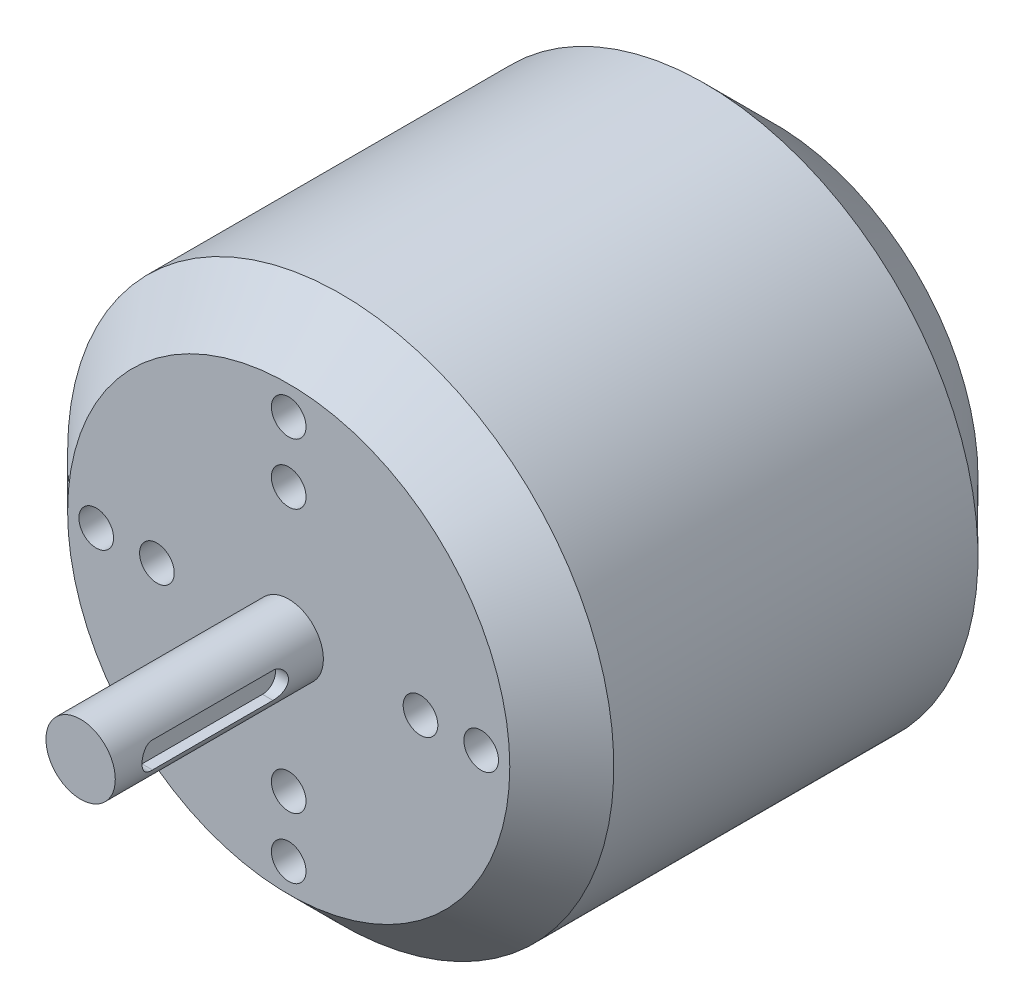
ISO-10303-21;
HEADER;
FILE_DESCRIPTION(('STEP AP214'),'2;1');
FILE_NAME('part.step','',(''),(''),'','','');
FILE_SCHEMA(('AUTOMOTIVE_DESIGN { 1 0 10303 214 1 1 1 1 }'));
ENDSEC;
DATA;
#1=APPLICATION_CONTEXT('core data for automotive mechanical design processes');
#2=APPLICATION_PROTOCOL_DEFINITION('international standard','automotive_design',2000,#1);
#3=PRODUCT_CONTEXT('',#1,'mechanical');
#4=PRODUCT('Part','Part','',(#3));
#5=PRODUCT_RELATED_PRODUCT_CATEGORY('part','',(#4));
#6=PRODUCT_DEFINITION_FORMATION('','',#4);
#7=PRODUCT_DEFINITION_CONTEXT('part definition',#1,'design');
#8=PRODUCT_DEFINITION('design','',#6,#7);
#9=PRODUCT_DEFINITION_SHAPE('','',#8);
#10=(LENGTH_UNIT() NAMED_UNIT(*) SI_UNIT(.MILLI.,.METRE.));
#11=(NAMED_UNIT(*) PLANE_ANGLE_UNIT() SI_UNIT($,.RADIAN.));
#12=(NAMED_UNIT(*) SI_UNIT($,.STERADIAN.) SOLID_ANGLE_UNIT());
#13=UNCERTAINTY_MEASURE_WITH_UNIT(LENGTH_MEASURE(1.E-05),#10,'distance_accuracy_value','');
#14=(GEOMETRIC_REPRESENTATION_CONTEXT(3) GLOBAL_UNCERTAINTY_ASSIGNED_CONTEXT((#13)) GLOBAL_UNIT_ASSIGNED_CONTEXT((#10,
#11,#12)) REPRESENTATION_CONTEXT('',''));
#15=CARTESIAN_POINT('',(0.,0.,0.));
#16=DIRECTION('',(0.,0.,1.));
#17=DIRECTION('',(1.,0.,0.));
#18=AXIS2_PLACEMENT_3D('',#15,#16,#17);
#19=CARTESIAN_POINT('',(0.,0.,72.));
#20=DIRECTION('',(0.,0.,-1.));
#21=DIRECTION('',(-1.,0.,0.));
#22=AXIS2_PLACEMENT_3D('',#19,#20,#21);
#23=CYLINDRICAL_SURFACE('',#22,4.);
#24=CARTESIAN_POINT('',(0.,0.,48.));
#25=DIRECTION('',(0.,0.,1.));
#26=DIRECTION('',(1.,0.,0.));
#27=AXIS2_PLACEMENT_3D('',#24,#25,#26);
#28=CIRCLE('',#27,4.);
#29=CARTESIAN_POINT('',(4.,0.,48.));
#30=VERTEX_POINT('',#29);
#31=EDGE_CURVE('E163',#30,#30,#28,.T.);
#32=ORIENTED_EDGE('',*,*,#31,.T.);
#33=EDGE_LOOP('',(#32));
#34=FACE_BOUND('',#33,.T.);
#35=CARTESIAN_POINT('',(0.,0.,72.));
#36=DIRECTION('',(0.,0.,1.));
#37=DIRECTION('',(1.,0.,0.));
#38=AXIS2_PLACEMENT_3D('',#35,#36,#37);
#39=CIRCLE('',#38,4.);
#40=CARTESIAN_POINT('',(4.,0.,72.));
#41=VERTEX_POINT('',#40);
#42=EDGE_CURVE('E157',#41,#41,#39,.T.);
#43=ORIENTED_EDGE('',*,*,#42,.F.);
#44=EDGE_LOOP('',(#43));
#45=FACE_BOUND('',#44,.T.);
#46=CARTESIAN_POINT('',(3.70809924354783,1.5,67.4185376928396));
#47=CARTESIAN_POINT('',(3.70809443619348,1.50000149729856,67.4591302258692));
#48=CARTESIAN_POINT('',(3.70876663375751,1.49835118206537,67.4997016221274));
#49=CARTESIAN_POINT('',(3.71141673218275,1.49177905295192,67.5805222315669));
#50=CARTESIAN_POINT('',(3.7133941946446,1.48685833749724,67.6207715483328));
#51=CARTESIAN_POINT('',(3.72118975606221,1.46729482367934,67.7403049085649));
#52=CARTESIAN_POINT('',(3.72887188404209,1.44784998767984,67.8187373530668));
#53=CARTESIAN_POINT('',(3.74825217997878,1.39690233043372,67.9709052113547));
#54=CARTESIAN_POINT('',(3.7599469632381,1.36540966903062,68.0446445218803));
#55=CARTESIAN_POINT('',(3.7860238820009,1.29134097725474,68.1858712129009));
#56=CARTESIAN_POINT('',(3.80040821426565,1.24875587557703,68.253353414852));
#57=CARTESIAN_POINT('',(3.83103589828726,1.15146603872017,68.3834296127803));
#58=CARTESIAN_POINT('',(3.84733374054252,1.09630269892844,68.4456677071578));
#59=CARTESIAN_POINT('',(3.8794978206844,0.976394584974257,68.560261285857));
#60=CARTESIAN_POINT('',(3.8953639745168,0.911647960429704,68.61261485718));
#61=CARTESIAN_POINT('',(3.92552893891845,0.771693719740037,68.7076779070932));
#62=CARTESIAN_POINT('',(3.93975598379754,0.696204968758626,68.7499982935233));
#63=CARTESIAN_POINT('',(3.96438035322528,0.53855362230492,68.8211896039225));
#64=CARTESIAN_POINT('',(3.97477910532575,0.456393528521804,68.8500655423265));
#65=CARTESIAN_POINT('',(3.99018690464435,0.291490050670588,68.8922954116612));
#66=CARTESIAN_POINT('',(3.99540906103972,0.20892464921191,68.9062650771436));
#67=CARTESIAN_POINT('',(4.00064014015322,0.0424658385808888,68.9202588907716));
#68=CARTESIAN_POINT('',(4.00065066686691,-0.0414271540462085,68.9202873296415));
#69=CARTESIAN_POINT('',(3.99559264174046,-0.203744100069406,68.9067558866106));
#70=CARTESIAN_POINT('',(3.99077535168083,-0.282233282883082,68.8938682176322));
#71=CARTESIAN_POINT('',(3.97693262269583,-0.435840275995115,68.8560014217274));
#72=CARTESIAN_POINT('',(3.96790694481372,-0.51095789458693,68.8310216081933));
#73=CARTESIAN_POINT('',(3.94637770601049,-0.656988917196577,68.7693673002438));
#74=CARTESIAN_POINT('',(3.93382542785069,-0.727825198012178,68.7325278519162));
#75=CARTESIAN_POINT('',(3.90651314175191,-0.862486444375064,68.6483456552665));
#76=CARTESIAN_POINT('',(3.89175241632298,-0.926309119580088,68.6009994910523));
#77=CARTESIAN_POINT('',(3.86052643048223,-1.04908600084313,68.4939145613485));
#78=CARTESIAN_POINT('',(3.84401196825707,-1.10753779261244,68.4336133085046));
#79=CARTESIAN_POINT('',(3.81182684214318,-1.21369725159035,68.3039535584618));
#80=CARTESIAN_POINT('',(3.79615651174147,-1.26140069584828,68.2345915181922));
#81=CARTESIAN_POINT('',(3.7671186794103,-1.34567998313248,68.0867796644258));
#82=CARTESIAN_POINT('',(3.75381153298453,-1.38197861969245,68.008159287172));
#83=CARTESIAN_POINT('',(3.73171449181344,-1.44059114536973,67.8453313709977));
#84=CARTESIAN_POINT('',(3.72291700934124,-1.46292853893353,67.7611334879067));
#85=CARTESIAN_POINT('',(3.7140622685257,-1.48519272209728,67.6331566751918));
#86=CARTESIAN_POINT('',(3.71183476402566,-1.49074028414002,67.590435363319));
#87=CARTESIAN_POINT('',(3.70885093143242,-1.49814308997677,67.5046636239679));
#88=CARTESIAN_POINT('',(3.70809323601798,-1.50000176547338,67.4616135398102));
#89=CARTESIAN_POINT('',(3.70809924354783,-1.5,67.4185376928396));
#90=B_SPLINE_CURVE_WITH_KNOTS('',3,(#46,#47,#48,#49,#50,#51,#52,#53,#54,#55,#56,#57,#58,#59,#60,
#61,#62,#63,#64,#65,#66,#67,#68,#69,#70,#71,#72,#73,#74,#75,#76,#77,#78,#79,#80,#81,#82,#83,#84,
#85,#86,#87,#88,#89),.UNSPECIFIED.,.F.,.F.,(4,2,2,2,2,2,2,2,2,2,2,2,2,2,2,2,2,2,2,2,2,4),(0.,
0.121697465666185,0.243354077586423,0.485593064591345,0.727628221921996,0.969861938431276,
1.22298027419407,1.47614754705133,1.73793539440998,1.9996255232324,2.25002925199203,
2.50035591335681,2.73829765644058,2.97625291175452,3.21767225141683,3.45917019544674,
3.71477993951631,3.97048993642582,4.23200510445915,4.4930788043249,4.62233004062785,
4.75146098044212),.UNSPECIFIED.);
#91=CARTESIAN_POINT('',(3.70809924354783,1.5,67.4185376928396));
#92=VERTEX_POINT('',#91);
#93=CARTESIAN_POINT('',(3.70809924354783,-1.5,67.4185376928396));
#94=VERTEX_POINT('',#93);
#95=EDGE_CURVE('E11',#92,#94,#90,.T.);
#96=ORIENTED_EDGE('',*,*,#95,.F.);
#97=DIRECTION('',(0.,0.,-1.));
#98=VECTOR('',#97,1.);
#99=CARTESIAN_POINT('',(3.70809924354783,1.5,72.));
#100=LINE('',#99,#98);
#101=CARTESIAN_POINT('',(3.70809924354783,1.5,53.5270847484594));
#102=VERTEX_POINT('',#101);
#103=EDGE_CURVE('E166',#102,#92,#100,.F.);
#104=ORIENTED_EDGE('',*,*,#103,.F.);
#105=CARTESIAN_POINT('',(3.70809924354783,-1.5,53.5270847484594));
#106=CARTESIAN_POINT('',(3.70809443619348,-1.50000149729856,53.4864922154298));
#107=CARTESIAN_POINT('',(3.70876663375751,-1.49835118206537,53.4459208191717));
#108=CARTESIAN_POINT('',(3.71141673218275,-1.49177905295192,53.3651002097321));
#109=CARTESIAN_POINT('',(3.7133941946446,-1.48685833749724,53.3248508929662));
#110=CARTESIAN_POINT('',(3.72118975606221,-1.46729482367935,53.2053175327342));
#111=CARTESIAN_POINT('',(3.72887188404209,-1.44784998767984,53.1268850882323));
#112=CARTESIAN_POINT('',(3.74825217997878,-1.39690233043372,52.9747172299443));
#113=CARTESIAN_POINT('',(3.7599469632381,-1.36540966903062,52.9009779194187));
#114=CARTESIAN_POINT('',(3.7860238820009,-1.29134097725474,52.7597512283981));
#115=CARTESIAN_POINT('',(3.80040821426565,-1.24875587557702,52.692269026447));
#116=CARTESIAN_POINT('',(3.83103589828726,-1.15146603872017,52.5621928285187));
#117=CARTESIAN_POINT('',(3.84733374054252,-1.09630269892843,52.4999547341412));
#118=CARTESIAN_POINT('',(3.8794978206844,-0.976394584974257,52.385361155442));
#119=CARTESIAN_POINT('',(3.8953639745168,-0.911647960429703,52.333007584119));
#120=CARTESIAN_POINT('',(3.92552893891845,-0.771693719740038,52.2379445342058));
#121=CARTESIAN_POINT('',(3.93975598379754,-0.696204968758629,52.1956241477757));
#122=CARTESIAN_POINT('',(3.96438035322528,-0.538553622304924,52.1244328373765));
#123=CARTESIAN_POINT('',(3.97477910532575,-0.456393528521805,52.0955568989725));
#124=CARTESIAN_POINT('',(3.99018690464435,-0.291490050670587,52.0533270296378));
#125=CARTESIAN_POINT('',(3.99540906103972,-0.208924649211908,52.0393573641555));
#126=CARTESIAN_POINT('',(4.00064014015322,-0.0424658385808867,52.0253635505274));
#127=CARTESIAN_POINT('',(4.00065066686691,0.0414271540462115,52.0253351116575));
#128=CARTESIAN_POINT('',(3.99559264174045,0.203744100069408,52.0388665546884));
#129=CARTESIAN_POINT('',(3.99077535168083,0.282233282883084,52.0517542236668));
#130=CARTESIAN_POINT('',(3.97693262269583,0.435840275995115,52.0896210195716));
#131=CARTESIAN_POINT('',(3.96790694481372,0.51095789458693,52.1146008331057));
#132=CARTESIAN_POINT('',(3.94637770601049,0.656988917196577,52.1762551410552));
#133=CARTESIAN_POINT('',(3.93382542785069,0.727825198012178,52.2130945893828));
#134=CARTESIAN_POINT('',(3.90651314175191,0.862486444375064,52.2972767860325));
#135=CARTESIAN_POINT('',(3.89175241632298,0.926309119580088,52.3446229502468));
#136=CARTESIAN_POINT('',(3.86052643048223,1.04908600084313,52.4517078799505));
#137=CARTESIAN_POINT('',(3.84401196825707,1.10753779261244,52.5120091327944));
#138=CARTESIAN_POINT('',(3.81182684214318,1.21369725159035,52.6416688828372));
#139=CARTESIAN_POINT('',(3.79615651174147,1.26140069584828,52.7110309231069));
#140=CARTESIAN_POINT('',(3.7671186794103,1.34567998313248,52.8588427768732));
#141=CARTESIAN_POINT('',(3.75381153298453,1.38197861969245,52.937463154127));
#142=CARTESIAN_POINT('',(3.73171449181344,1.44059114536973,53.1002910703013));
#143=CARTESIAN_POINT('',(3.72291700934124,1.46292853893353,53.1844889533924));
#144=CARTESIAN_POINT('',(3.7140622685257,1.48519272209728,53.3124657661072));
#145=CARTESIAN_POINT('',(3.71183476402566,1.49074028414002,53.35518707798));
#146=CARTESIAN_POINT('',(3.70885093143242,1.49814308997677,53.4409588173312));
#147=CARTESIAN_POINT('',(3.70809323601798,1.50000176547338,53.4840089014888));
#148=CARTESIAN_POINT('',(3.70809924354783,1.5,53.5270847484594));
#149=B_SPLINE_CURVE_WITH_KNOTS('',3,(#105,#106,#107,#108,#109,#110,#111,#112,#113,#114,#115,
#116,#117,#118,#119,#120,#121,#122,#123,#124,#125,#126,#127,#128,#129,#130,#131,#132,#133,#134,
#135,#136,#137,#138,#139,#140,#141,#142,#143,#144,#145,#146,#147,#148),.UNSPECIFIED.,.F.,.F.,(4,
2,2,2,2,2,2,2,2,2,2,2,2,2,2,2,2,2,2,2,2,4),(0.,0.121697465666185,0.243354077586416,
0.485593064591345,0.727628221922012,0.969861938431285,1.22298027419407,1.47614754705134,
1.73793539440997,1.9996255232324,2.25002925199203,2.50035591335681,2.73829765644058,
2.97625291175452,3.21767225141682,3.45917019544674,3.71477993951631,3.97048993642583,
4.23200510445915,4.49307880432491,4.62233004062784,4.75146098044213),.UNSPECIFIED.);
#150=CARTESIAN_POINT('',(3.70809924354783,-1.5,53.5270847484594));
#151=VERTEX_POINT('',#150);
#152=EDGE_CURVE('E185',#151,#102,#149,.T.);
#153=ORIENTED_EDGE('',*,*,#152,.F.);
#154=DIRECTION('',(0.,0.,-1.));
#155=VECTOR('',#154,1.);
#156=CARTESIAN_POINT('',(3.70809924354783,-1.5,72.));
#157=LINE('',#156,#155);
#158=EDGE_CURVE('E52',#94,#151,#157,.T.);
#159=ORIENTED_EDGE('',*,*,#158,.F.);
#160=EDGE_LOOP('',(#96,#104,#153,#159));
#161=FACE_BOUND('',#160,.T.);
#162=ADVANCED_FACE('F38',(#34,#45,#161),#23,.T.);
#163=CARTESIAN_POINT('',(0.,0.,42.));
#164=DIRECTION('',(0.,0.,-1.));
#165=DIRECTION('',(-1.,0.,0.));
#166=AXIS2_PLACEMENT_3D('',#163,#164,#165);
#167=CYLINDRICAL_SURFACE('',#166,31.5);
#168=CARTESIAN_POINT('',(0.,0.,0.));
#169=DIRECTION('',(0.,0.,-1.));
#170=DIRECTION('',(-1.,0.,0.));
#171=AXIS2_PLACEMENT_3D('',#168,#169,#170);
#172=CIRCLE('',#171,31.5);
#173=CARTESIAN_POINT('',(-31.5,0.,0.));
#174=VERTEX_POINT('',#173);
#175=EDGE_CURVE('E173',#174,#174,#172,.F.);
#176=CARTESIAN_POINT('',(0.,0.,42.));
#177=DIRECTION('',(0.,0.,1.));
#178=DIRECTION('',(1.,0.,0.));
#179=AXIS2_PLACEMENT_3D('',#176,#177,#178);
#180=CIRCLE('',#179,31.5);
#181=CARTESIAN_POINT('',(-31.5,0.,42.));
#182=VERTEX_POINT('',#181);
#183=EDGE_CURVE('E176',#182,#182,#180,.F.);
#184=CARTESIAN_POINT('',(-31.5,0.,0.));
#185=CARTESIAN_POINT('',(-31.5,0.,0.4375));
#186=CARTESIAN_POINT('',(-31.5,0.,0.875000000000001));
#187=CARTESIAN_POINT('',(-31.5,0.,1.75));
#188=CARTESIAN_POINT('',(-31.5,0.,2.1875));
#189=CARTESIAN_POINT('',(-31.5,0.,3.0625));
#190=CARTESIAN_POINT('',(-31.5,0.,3.5));
#191=CARTESIAN_POINT('',(-31.5,0.,4.375));
#192=CARTESIAN_POINT('',(-31.5,0.,4.8125));
#193=CARTESIAN_POINT('',(-31.5,0.,5.6875));
#194=CARTESIAN_POINT('',(-31.5,0.,6.125));
#195=CARTESIAN_POINT('',(-31.5,0.,7.));
#196=CARTESIAN_POINT('',(-31.5,0.,7.4375));
#197=CARTESIAN_POINT('',(-31.5,0.,8.3125));
#198=CARTESIAN_POINT('',(-31.5,0.,8.75));
#199=CARTESIAN_POINT('',(-31.5,0.,9.625));
#200=CARTESIAN_POINT('',(-31.5,0.,10.0625));
#201=CARTESIAN_POINT('',(-31.5,0.,10.9375));
#202=CARTESIAN_POINT('',(-31.5,0.,11.375));
#203=CARTESIAN_POINT('',(-31.5,0.,12.25));
#204=CARTESIAN_POINT('',(-31.5,0.,12.6875));
#205=CARTESIAN_POINT('',(-31.5,0.,13.5625));
#206=CARTESIAN_POINT('',(-31.5,0.,14.));
#207=CARTESIAN_POINT('',(-31.5,0.,14.875));
#208=CARTESIAN_POINT('',(-31.5,0.,15.3125));
#209=CARTESIAN_POINT('',(-31.5,0.,16.1875));
#210=CARTESIAN_POINT('',(-31.5,0.,16.625));
#211=CARTESIAN_POINT('',(-31.5,0.,17.5));
#212=CARTESIAN_POINT('',(-31.5,0.,17.9375));
#213=CARTESIAN_POINT('',(-31.5,0.,18.8125));
#214=CARTESIAN_POINT('',(-31.5,0.,19.25));
#215=CARTESIAN_POINT('',(-31.5,0.,20.125));
#216=CARTESIAN_POINT('',(-31.5,0.,20.5625));
#217=CARTESIAN_POINT('',(-31.5,0.,21.4375));
#218=CARTESIAN_POINT('',(-31.5,0.,21.875));
#219=CARTESIAN_POINT('',(-31.5,0.,22.75));
#220=CARTESIAN_POINT('',(-31.5,0.,23.1875));
#221=CARTESIAN_POINT('',(-31.5,0.,24.0625));
#222=CARTESIAN_POINT('',(-31.5,0.,24.5));
#223=CARTESIAN_POINT('',(-31.5,0.,25.375));
#224=CARTESIAN_POINT('',(-31.5,0.,25.8125));
#225=CARTESIAN_POINT('',(-31.5,0.,26.6875));
#226=CARTESIAN_POINT('',(-31.5,0.,27.125));
#227=CARTESIAN_POINT('',(-31.5,0.,28.));
#228=CARTESIAN_POINT('',(-31.5,0.,28.4375));
#229=CARTESIAN_POINT('',(-31.5,0.,29.3125));
#230=CARTESIAN_POINT('',(-31.5,0.,29.75));
#231=CARTESIAN_POINT('',(-31.5,0.,30.625));
#232=CARTESIAN_POINT('',(-31.5,0.,31.0625));
#233=CARTESIAN_POINT('',(-31.5,0.,31.9375));
#234=CARTESIAN_POINT('',(-31.5,0.,32.375));
#235=CARTESIAN_POINT('',(-31.5,0.,33.25));
#236=CARTESIAN_POINT('',(-31.5,0.,33.6875));
#237=CARTESIAN_POINT('',(-31.5,0.,34.5625));
#238=CARTESIAN_POINT('',(-31.5,0.,35.));
#239=CARTESIAN_POINT('',(-31.5,0.,35.875));
#240=CARTESIAN_POINT('',(-31.5,0.,36.3125));
#241=CARTESIAN_POINT('',(-31.5,0.,37.1875));
#242=CARTESIAN_POINT('',(-31.5,0.,37.625));
#243=CARTESIAN_POINT('',(-31.5,0.,38.5));
#244=CARTESIAN_POINT('',(-31.5,0.,38.9375));
#245=CARTESIAN_POINT('',(-31.5,0.,39.8125));
#246=CARTESIAN_POINT('',(-31.5,0.,40.25));
#247=CARTESIAN_POINT('',(-31.5,0.,41.125));
#248=CARTESIAN_POINT('',(-31.5,0.,41.5625));
#249=CARTESIAN_POINT('',(-31.5,0.,42.));
#250=B_SPLINE_CURVE_WITH_KNOTS('',3,(#184,#185,#186,#187,#188,#189,#190,#191,#192,#193,#194,
#195,#196,#197,#198,#199,#200,#201,#202,#203,#204,#205,#206,#207,#208,#209,#210,#211,#212,#213,
#214,#215,#216,#217,#218,#219,#220,#221,#222,#223,#224,#225,#226,#227,#228,#229,#230,#231,#232,
#233,#234,#235,#236,#237,#238,#239,#240,#241,#242,#243,#244,#245,#246,#247,#248,#249),
.UNSPECIFIED.,.F.,.F.,(4,2,2,2,2,2,2,2,2,2,2,2,2,2,2,2,2,2,2,2,2,2,2,2,2,2,2,2,2,2,2,2,4),(0.,
1.3125,2.625,3.9375,5.25,6.5625,7.875,9.1875,10.5,11.8125,13.125,14.4375,15.75,17.0625,18.375,
19.6875,21.,22.3125,23.625,24.9375,26.25,27.5625,28.875,30.1875,31.5,32.8125,34.125,35.4375,
36.75,38.0625,39.375,40.6875,42.),.UNSPECIFIED.);
#251=EDGE_CURVE('BSEAM279',#174,#182,#250,.T.);
#252=ORIENTED_EDGE('',*,*,#175,.T.);
#253=ORIENTED_EDGE('',*,*,#183,.T.);
#254=ORIENTED_EDGE('',*,*,#251,.T.);
#255=ORIENTED_EDGE('',*,*,#251,.F.);
#256=EDGE_LOOP('',(#252,#254,#253,#255));
#257=FACE_BOUND('',#256,.T.);
#258=ADVANCED_FACE('F279',(#257),#167,.T.);
#259=CARTESIAN_POINT('',(0.,0.,48.));
#260=DIRECTION('',(0.,0.,1.));
#261=DIRECTION('',(1.,0.,0.));
#262=AXIS2_PLACEMENT_3D('',#259,#260,#261);
#263=PLANE('',#262);
#264=CARTESIAN_POINT('',(2.10232574252353E-12,-15.2,48.));
#265=DIRECTION('',(0.,0.,1.));
#266=DIRECTION('',(1.,0.,0.));
#267=AXIS2_PLACEMENT_3D('',#264,#265,#266);
#268=CIRCLE('',#267,2.00000000000211);
#269=CARTESIAN_POINT('',(2.00000000000421,-15.2,48.));
#270=VERTEX_POINT('',#269);
#271=EDGE_CURVE('E115',#270,#270,#268,.T.);
#272=ORIENTED_EDGE('',*,*,#271,.F.);
#273=EDGE_LOOP('',(#272));
#274=FACE_BOUND('',#273,.T.);
#275=CARTESIAN_POINT('',(22.200000000001,1.05159149764147E-12,48.));
#276=DIRECTION('',(0.,0.,1.));
#277=DIRECTION('',(1.,0.,0.));
#278=AXIS2_PLACEMENT_3D('',#275,#276,#277);
#279=CIRCLE('',#278,2.00000000000077);
#280=CARTESIAN_POINT('',(24.2000000000018,1.05159149764147E-12,48.));
#281=VERTEX_POINT('',#280);
#282=EDGE_CURVE('E134',#281,#281,#279,.T.);
#283=ORIENTED_EDGE('',*,*,#282,.F.);
#284=EDGE_LOOP('',(#283));
#285=FACE_BOUND('',#284,.T.);
#286=CARTESIAN_POINT('',(15.2000000000011,1.05116287126176E-12,48.));
#287=DIRECTION('',(0.,0.,1.));
#288=DIRECTION('',(1.,0.,0.));
#289=AXIS2_PLACEMENT_3D('',#286,#287,#288);
#290=CIRCLE('',#289,2.00000000000075);
#291=CARTESIAN_POINT('',(17.2000000000018,1.05116287126176E-12,48.));
#292=VERTEX_POINT('',#291);
#293=EDGE_CURVE('E133',#292,#292,#290,.T.);
#294=ORIENTED_EDGE('',*,*,#293,.F.);
#295=EDGE_LOOP('',(#294));
#296=FACE_BOUND('',#295,.T.);
#297=CARTESIAN_POINT('',(0.,22.2,48.));
#298=DIRECTION('',(0.,0.,1.));
#299=DIRECTION('',(1.,0.,0.));
#300=AXIS2_PLACEMENT_3D('',#297,#298,#299);
#301=CIRCLE('',#300,2.);
#302=CARTESIAN_POINT('',(2.,22.2,48.));
#303=VERTEX_POINT('',#302);
#304=EDGE_CURVE('E146',#303,#303,#301,.T.);
#305=ORIENTED_EDGE('',*,*,#304,.F.);
#306=EDGE_LOOP('',(#305));
#307=FACE_BOUND('',#306,.T.);
#308=CARTESIAN_POINT('',(2.10318299528293E-12,-22.2,48.));
#309=DIRECTION('',(0.,0.,1.));
#310=DIRECTION('',(1.,0.,0.));
#311=AXIS2_PLACEMENT_3D('',#308,#309,#310);
#312=CIRCLE('',#311,2.00000000000216);
#313=CARTESIAN_POINT('',(2.00000000000426,-22.2,48.));
#314=VERTEX_POINT('',#313);
#315=EDGE_CURVE('E116',#314,#314,#312,.T.);
#316=ORIENTED_EDGE('',*,*,#315,.F.);
#317=EDGE_LOOP('',(#316));
#318=FACE_BOUND('',#317,.T.);
#319=CARTESIAN_POINT('',(-15.199999999999,-1.05302433439647E-12,48.));
#320=DIRECTION('',(0.,0.,1.));
#321=DIRECTION('',(1.,0.,0.));
#322=AXIS2_PLACEMENT_3D('',#319,#320,#321);
#323=CIRCLE('',#322,2.00000000000147);
#324=CARTESIAN_POINT('',(-13.1999999999975,-1.05302433439647E-12,48.));
#325=VERTEX_POINT('',#324);
#326=EDGE_CURVE('E122',#325,#325,#323,.T.);
#327=ORIENTED_EDGE('',*,*,#326,.F.);
#328=EDGE_LOOP('',(#327));
#329=FACE_BOUND('',#328,.T.);
#330=CARTESIAN_POINT('',(-22.199999999999,-1.05431021353557E-12,48.));
#331=DIRECTION('',(0.,0.,1.));
#332=DIRECTION('',(1.,0.,0.));
#333=AXIS2_PLACEMENT_3D('',#330,#331,#332);
#334=CIRCLE('',#333,2.00000000000154);
#335=CARTESIAN_POINT('',(-20.1999999999974,-1.05431021353557E-12,48.));
#336=VERTEX_POINT('',#335);
#337=EDGE_CURVE('E89',#336,#336,#334,.T.);
#338=ORIENTED_EDGE('',*,*,#337,.F.);
#339=EDGE_LOOP('',(#338));
#340=FACE_BOUND('',#339,.T.);
#341=CARTESIAN_POINT('',(0.,15.2,48.));
#342=DIRECTION('',(0.,0.,1.));
#343=DIRECTION('',(1.,0.,0.));
#344=AXIS2_PLACEMENT_3D('',#341,#342,#343);
#345=CIRCLE('',#344,2.);
#346=CARTESIAN_POINT('',(2.,15.2,48.));
#347=VERTEX_POINT('',#346);
#348=EDGE_CURVE('E145',#347,#347,#345,.T.);
#349=ORIENTED_EDGE('',*,*,#348,.F.);
#350=EDGE_LOOP('',(#349));
#351=FACE_BOUND('',#350,.T.);
#352=ORIENTED_EDGE('',*,*,#31,.F.);
#353=EDGE_LOOP('',(#352));
#354=FACE_BOUND('',#353,.T.);
#355=CARTESIAN_POINT('',(0.,0.,48.));
#356=DIRECTION('',(0.,0.,1.));
#357=DIRECTION('',(1.,0.,0.));
#358=AXIS2_PLACEMENT_3D('',#355,#356,#357);
#359=CIRCLE('',#358,25.5);
#360=CARTESIAN_POINT('',(25.5,0.,48.));
#361=VERTEX_POINT('',#360);
#362=EDGE_CURVE('E170',#361,#361,#359,.T.);
#363=ORIENTED_EDGE('',*,*,#362,.T.);
#364=EDGE_LOOP('',(#363));
#365=FACE_BOUND('',#364,.T.);
#366=ADVANCED_FACE('F284',(#274,#285,#296,#307,#318,#329,#340,#351,#354,#365),#263,.T.);
#367=CARTESIAN_POINT('',(0.,0.,48.));
#368=DIRECTION('',(0.,0.,-1.));
#369=DIRECTION('',(-1.,0.,0.));
#370=AXIS2_PLACEMENT_3D('',#367,#368,#369);
#371=CONICAL_SURFACE('',#370,25.5,0.785398163397448);
#372=ORIENTED_EDGE('',*,*,#183,.F.);
#373=EDGE_LOOP('',(#372));
#374=FACE_BOUND('',#373,.T.);
#375=ORIENTED_EDGE('',*,*,#362,.F.);
#376=EDGE_LOOP('',(#375));
#377=FACE_BOUND('',#376,.T.);
#378=ADVANCED_FACE('F450',(#374,#377),#371,.T.);
#379=CARTESIAN_POINT('',(0.,0.,-8.));
#380=DIRECTION('',(0.,0.,-1.));
#381=DIRECTION('',(-1.,0.,0.));
#382=AXIS2_PLACEMENT_3D('',#379,#380,#381);
#383=PLANE('',#382);
#384=CARTESIAN_POINT('',(0.,0.,-8.));
#385=DIRECTION('',(0.,0.,-1.));
#386=DIRECTION('',(-1.,0.,0.));
#387=AXIS2_PLACEMENT_3D('',#384,#385,#386);
#388=CIRCLE('',#387,7.5);
#389=CARTESIAN_POINT('',(-7.5,0.,-8.));
#390=VERTEX_POINT('',#389);
#391=EDGE_CURVE('E167',#390,#390,#388,.T.);
#392=ORIENTED_EDGE('',*,*,#391,.F.);
#393=EDGE_LOOP('',(#392));
#394=FACE_BOUND('',#393,.T.);
#395=CARTESIAN_POINT('',(0.,0.,-8.));
#396=DIRECTION('',(0.,0.,-1.));
#397=DIRECTION('',(-1.,0.,0.));
#398=AXIS2_PLACEMENT_3D('',#395,#396,#397);
#399=CIRCLE('',#398,23.5);
#400=CARTESIAN_POINT('',(-23.5,0.,-8.));
#401=VERTEX_POINT('',#400);
#402=EDGE_CURVE('E179',#401,#401,#399,.T.);
#403=ORIENTED_EDGE('',*,*,#402,.T.);
#404=EDGE_LOOP('',(#403));
#405=FACE_BOUND('',#404,.T.);
#406=ADVANCED_FACE('F483',(#394,#405),#383,.T.);
#407=CARTESIAN_POINT('',(0.,0.,-8.));
#408=DIRECTION('',(0.,0.,1.));
#409=DIRECTION('',(1.,0.,0.));
#410=AXIS2_PLACEMENT_3D('',#407,#408,#409);
#411=CONICAL_SURFACE('',#410,23.5,0.785398163397448);
#412=ORIENTED_EDGE('',*,*,#175,.F.);
#413=EDGE_LOOP('',(#412));
#414=FACE_BOUND('',#413,.T.);
#415=ORIENTED_EDGE('',*,*,#402,.F.);
#416=EDGE_LOOP('',(#415));
#417=FACE_BOUND('',#416,.T.);
#418=ADVANCED_FACE('F40',(#414,#417),#411,.T.);
#419=CARTESIAN_POINT('',(0.,0.,-9.));
#420=DIRECTION('',(0.,0.,1.));
#421=DIRECTION('',(1.,0.,0.));
#422=AXIS2_PLACEMENT_3D('',#419,#420,#421);
#423=CYLINDRICAL_SURFACE('',#422,7.5);
#424=CARTESIAN_POINT('',(0.,0.,-9.));
#425=DIRECTION('',(0.,0.,-1.));
#426=DIRECTION('',(-1.,0.,0.));
#427=AXIS2_PLACEMENT_3D('',#424,#425,#426);
#428=CIRCLE('',#427,7.5);
#429=CARTESIAN_POINT('',(-7.5,0.,-9.));
#430=VERTEX_POINT('',#429);
#431=EDGE_CURVE('E162',#430,#430,#428,.T.);
#432=ORIENTED_EDGE('',*,*,#431,.F.);
#433=EDGE_LOOP('',(#432));
#434=FACE_BOUND('',#433,.T.);
#435=ORIENTED_EDGE('',*,*,#391,.T.);
#436=EDGE_LOOP('',(#435));
#437=FACE_BOUND('',#436,.T.);
#438=ADVANCED_FACE('F276',(#434,#437),#423,.T.);
#439=CARTESIAN_POINT('',(0.,0.,-9.));
#440=DIRECTION('',(0.,0.,-1.));
#441=DIRECTION('',(-1.,0.,0.));
#442=AXIS2_PLACEMENT_3D('',#439,#440,#441);
#443=PLANE('',#442);
#444=ORIENTED_EDGE('',*,*,#431,.T.);
#445=EDGE_LOOP('',(#444));
#446=FACE_BOUND('',#445,.T.);
#447=ADVANCED_FACE('F271',(#446),#443,.T.);
#448=CARTESIAN_POINT('',(0.,0.,72.));
#449=DIRECTION('',(0.,0.,1.));
#450=DIRECTION('',(1.,0.,0.));
#451=AXIS2_PLACEMENT_3D('',#448,#449,#450);
#452=PLANE('',#451);
#453=ORIENTED_EDGE('',*,*,#42,.T.);
#454=EDGE_LOOP('',(#453));
#455=FACE_BOUND('',#454,.T.);
#456=ADVANCED_FACE('F268',(#455),#452,.T.);
#457=CARTESIAN_POINT('',(0.,15.2,40.));
#458=DIRECTION('',(0.,0.,1.));
#459=DIRECTION('',(1.,0.,0.));
#460=AXIS2_PLACEMENT_3D('',#457,#458,#459);
#461=CYLINDRICAL_SURFACE('',#460,2.);
#462=CARTESIAN_POINT('',(0.,15.2,40.));
#463=DIRECTION('',(0.,0.,1.));
#464=DIRECTION('',(1.,0.,0.));
#465=AXIS2_PLACEMENT_3D('',#462,#463,#464);
#466=CIRCLE('',#465,2.);
#467=CARTESIAN_POINT('',(2.,15.2,40.));
#468=VERTEX_POINT('',#467);
#469=EDGE_CURVE('E154',#468,#468,#466,.T.);
#470=ORIENTED_EDGE('',*,*,#469,.F.);
#471=EDGE_LOOP('',(#470));
#472=FACE_BOUND('',#471,.T.);
#473=ORIENTED_EDGE('',*,*,#348,.T.);
#474=EDGE_LOOP('',(#473));
#475=FACE_BOUND('',#474,.T.);
#476=ADVANCED_FACE('F265',(#472,#475),#461,.F.);
#477=CARTESIAN_POINT('',(0.,15.2,40.));
#478=DIRECTION('',(0.,0.,1.));
#479=DIRECTION('',(1.,0.,0.));
#480=AXIS2_PLACEMENT_3D('',#477,#478,#479);
#481=PLANE('',#480);
#482=ORIENTED_EDGE('',*,*,#469,.T.);
#483=EDGE_LOOP('',(#482));
#484=FACE_BOUND('',#483,.T.);
#485=ADVANCED_FACE('F231',(#484),#481,.T.);
#486=CARTESIAN_POINT('',(-22.199999999999,-1.05431021353557E-12,40.));
#487=DIRECTION('',(0.,0.,1.));
#488=DIRECTION('',(1.,0.,0.));
#489=AXIS2_PLACEMENT_3D('',#486,#487,#488);
#490=CYLINDRICAL_SURFACE('',#489,2.00000000000154);
#491=CARTESIAN_POINT('',(-22.199999999999,-1.05431021353557E-12,40.));
#492=DIRECTION('',(0.,0.,1.));
#493=DIRECTION('',(1.,0.,0.));
#494=AXIS2_PLACEMENT_3D('',#491,#492,#493);
#495=CIRCLE('',#494,2.00000000000154);
#496=CARTESIAN_POINT('',(-20.1999999999974,-1.05431021353557E-12,40.));
#497=VERTEX_POINT('',#496);
#498=EDGE_CURVE('E125',#497,#497,#495,.T.);
#499=ORIENTED_EDGE('',*,*,#498,.F.);
#500=EDGE_LOOP('',(#499));
#501=FACE_BOUND('',#500,.T.);
#502=ORIENTED_EDGE('',*,*,#337,.T.);
#503=EDGE_LOOP('',(#502));
#504=FACE_BOUND('',#503,.T.);
#505=ADVANCED_FACE('F227',(#501,#504),#490,.F.);
#506=CARTESIAN_POINT('',(-22.199999999999,-1.05431021353557E-12,40.));
#507=DIRECTION('',(0.,0.,1.));
#508=DIRECTION('',(1.,0.,0.));
#509=AXIS2_PLACEMENT_3D('',#506,#507,#508);
#510=PLANE('',#509);
#511=ORIENTED_EDGE('',*,*,#498,.T.);
#512=EDGE_LOOP('',(#511));
#513=FACE_BOUND('',#512,.T.);
#514=ADVANCED_FACE('F223',(#513),#510,.T.);
#515=CARTESIAN_POINT('',(-15.199999999999,-1.05302433439647E-12,40.));
#516=DIRECTION('',(0.,0.,1.));
#517=DIRECTION('',(1.,0.,0.));
#518=AXIS2_PLACEMENT_3D('',#515,#516,#517);
#519=CYLINDRICAL_SURFACE('',#518,2.00000000000147);
#520=CARTESIAN_POINT('',(-15.199999999999,-1.05302433439647E-12,40.));
#521=DIRECTION('',(0.,0.,1.));
#522=DIRECTION('',(1.,0.,0.));
#523=AXIS2_PLACEMENT_3D('',#520,#521,#522);
#524=CIRCLE('',#523,2.00000000000147);
#525=CARTESIAN_POINT('',(-13.1999999999975,-1.05302433439647E-12,40.));
#526=VERTEX_POINT('',#525);
#527=EDGE_CURVE('E119',#526,#526,#524,.T.);
#528=ORIENTED_EDGE('',*,*,#527,.F.);
#529=EDGE_LOOP('',(#528));
#530=FACE_BOUND('',#529,.T.);
#531=ORIENTED_EDGE('',*,*,#326,.T.);
#532=EDGE_LOOP('',(#531));
#533=FACE_BOUND('',#532,.T.);
#534=ADVANCED_FACE('F219',(#530,#533),#519,.F.);
#535=CARTESIAN_POINT('',(-15.199999999999,-1.05302433439647E-12,40.));
#536=DIRECTION('',(0.,0.,1.));
#537=DIRECTION('',(1.,0.,0.));
#538=AXIS2_PLACEMENT_3D('',#535,#536,#537);
#539=PLANE('',#538);
#540=ORIENTED_EDGE('',*,*,#527,.T.);
#541=EDGE_LOOP('',(#540));
#542=FACE_BOUND('',#541,.T.);
#543=ADVANCED_FACE('F215',(#542),#539,.T.);
#544=CARTESIAN_POINT('',(2.10318299528293E-12,-22.2,40.));
#545=DIRECTION('',(0.,0.,1.));
#546=DIRECTION('',(1.,0.,0.));
#547=AXIS2_PLACEMENT_3D('',#544,#545,#546);
#548=CYLINDRICAL_SURFACE('',#547,2.00000000000216);
#549=CARTESIAN_POINT('',(2.10318299528293E-12,-22.2,40.));
#550=DIRECTION('',(0.,0.,1.));
#551=DIRECTION('',(1.,0.,0.));
#552=AXIS2_PLACEMENT_3D('',#549,#550,#551);
#553=CIRCLE('',#552,2.00000000000216);
#554=CARTESIAN_POINT('',(2.00000000000426,-22.2,40.));
#555=VERTEX_POINT('',#554);
#556=EDGE_CURVE('E112',#555,#555,#553,.T.);
#557=ORIENTED_EDGE('',*,*,#556,.F.);
#558=EDGE_LOOP('',(#557));
#559=FACE_BOUND('',#558,.T.);
#560=ORIENTED_EDGE('',*,*,#315,.T.);
#561=EDGE_LOOP('',(#560));
#562=FACE_BOUND('',#561,.T.);
#563=ADVANCED_FACE('F211',(#559,#562),#548,.F.);
#564=CARTESIAN_POINT('',(2.10318299528293E-12,-22.2,40.));
#565=DIRECTION('',(0.,0.,1.));
#566=DIRECTION('',(1.,0.,0.));
#567=AXIS2_PLACEMENT_3D('',#564,#565,#566);
#568=PLANE('',#567);
#569=ORIENTED_EDGE('',*,*,#556,.T.);
#570=EDGE_LOOP('',(#569));
#571=FACE_BOUND('',#570,.T.);
#572=ADVANCED_FACE('F207',(#571),#568,.T.);
#573=CARTESIAN_POINT('',(0.,22.2,40.));
#574=DIRECTION('',(0.,0.,1.));
#575=DIRECTION('',(1.,0.,0.));
#576=AXIS2_PLACEMENT_3D('',#573,#574,#575);
#577=CYLINDRICAL_SURFACE('',#576,2.);
#578=CARTESIAN_POINT('',(0.,22.2,40.));
#579=DIRECTION('',(0.,0.,1.));
#580=DIRECTION('',(1.,0.,0.));
#581=AXIS2_PLACEMENT_3D('',#578,#579,#580);
#582=CIRCLE('',#581,2.);
#583=CARTESIAN_POINT('',(2.,22.2,40.));
#584=VERTEX_POINT('',#583);
#585=EDGE_CURVE('E142',#584,#584,#582,.T.);
#586=ORIENTED_EDGE('',*,*,#585,.F.);
#587=EDGE_LOOP('',(#586));
#588=FACE_BOUND('',#587,.T.);
#589=ORIENTED_EDGE('',*,*,#304,.T.);
#590=EDGE_LOOP('',(#589));
#591=FACE_BOUND('',#590,.T.);
#592=ADVANCED_FACE('F210',(#588,#591),#577,.F.);
#593=CARTESIAN_POINT('',(0.,22.2,40.));
#594=DIRECTION('',(0.,0.,1.));
#595=DIRECTION('',(1.,0.,0.));
#596=AXIS2_PLACEMENT_3D('',#593,#594,#595);
#597=PLANE('',#596);
#598=ORIENTED_EDGE('',*,*,#585,.T.);
#599=EDGE_LOOP('',(#598));
#600=FACE_BOUND('',#599,.T.);
#601=ADVANCED_FACE('F249',(#600),#597,.T.);
#602=CARTESIAN_POINT('',(15.2000000000011,1.05116287126176E-12,40.));
#603=DIRECTION('',(0.,0.,1.));
#604=DIRECTION('',(1.,0.,0.));
#605=AXIS2_PLACEMENT_3D('',#602,#603,#604);
#606=CYLINDRICAL_SURFACE('',#605,2.00000000000075);
#607=CARTESIAN_POINT('',(15.2000000000011,1.05116287126176E-12,40.));
#608=DIRECTION('',(0.,0.,1.));
#609=DIRECTION('',(1.,0.,0.));
#610=AXIS2_PLACEMENT_3D('',#607,#608,#609);
#611=CIRCLE('',#610,2.00000000000075);
#612=CARTESIAN_POINT('',(17.2000000000018,1.05116287126176E-12,40.));
#613=VERTEX_POINT('',#612);
#614=EDGE_CURVE('E149',#613,#613,#611,.T.);
#615=ORIENTED_EDGE('',*,*,#614,.F.);
#616=EDGE_LOOP('',(#615));
#617=FACE_BOUND('',#616,.T.);
#618=ORIENTED_EDGE('',*,*,#293,.T.);
#619=EDGE_LOOP('',(#618));
#620=FACE_BOUND('',#619,.T.);
#621=ADVANCED_FACE('F252',(#617,#620),#606,.F.);
#622=CARTESIAN_POINT('',(15.2000000000011,1.05116287126176E-12,40.));
#623=DIRECTION('',(0.,0.,1.));
#624=DIRECTION('',(1.,0.,0.));
#625=AXIS2_PLACEMENT_3D('',#622,#623,#624);
#626=PLANE('',#625);
#627=ORIENTED_EDGE('',*,*,#614,.T.);
#628=EDGE_LOOP('',(#627));
#629=FACE_BOUND('',#628,.T.);
#630=ADVANCED_FACE('F241',(#629),#626,.T.);
#631=CARTESIAN_POINT('',(22.200000000001,1.05159149764147E-12,40.));
#632=DIRECTION('',(0.,0.,1.));
#633=DIRECTION('',(1.,0.,0.));
#634=AXIS2_PLACEMENT_3D('',#631,#632,#633);
#635=CYLINDRICAL_SURFACE('',#634,2.00000000000077);
#636=CARTESIAN_POINT('',(22.200000000001,1.05159149764147E-12,40.));
#637=DIRECTION('',(0.,0.,1.));
#638=DIRECTION('',(1.,0.,0.));
#639=AXIS2_PLACEMENT_3D('',#636,#637,#638);
#640=CIRCLE('',#639,2.00000000000077);
#641=CARTESIAN_POINT('',(24.2000000000018,1.05159149764147E-12,40.));
#642=VERTEX_POINT('',#641);
#643=EDGE_CURVE('E130',#642,#642,#640,.T.);
#644=ORIENTED_EDGE('',*,*,#643,.F.);
#645=EDGE_LOOP('',(#644));
#646=FACE_BOUND('',#645,.T.);
#647=ORIENTED_EDGE('',*,*,#282,.T.);
#648=EDGE_LOOP('',(#647));
#649=FACE_BOUND('',#648,.T.);
#650=ADVANCED_FACE('F237',(#646,#649),#635,.F.);
#651=CARTESIAN_POINT('',(22.200000000001,1.05159149764147E-12,40.));
#652=DIRECTION('',(0.,0.,1.));
#653=DIRECTION('',(1.,0.,0.));
#654=AXIS2_PLACEMENT_3D('',#651,#652,#653);
#655=PLANE('',#654);
#656=ORIENTED_EDGE('',*,*,#643,.T.);
#657=EDGE_LOOP('',(#656));
#658=FACE_BOUND('',#657,.T.);
#659=ADVANCED_FACE('F233',(#658),#655,.T.);
#660=CARTESIAN_POINT('',(2.10232574252353E-12,-15.2,40.));
#661=DIRECTION('',(0.,0.,1.));
#662=DIRECTION('',(1.,0.,0.));
#663=AXIS2_PLACEMENT_3D('',#660,#661,#662);
#664=CYLINDRICAL_SURFACE('',#663,2.00000000000211);
#665=CARTESIAN_POINT('',(2.10232574252353E-12,-15.2,40.));
#666=DIRECTION('',(0.,0.,1.));
#667=DIRECTION('',(1.,0.,0.));
#668=AXIS2_PLACEMENT_3D('',#665,#666,#667);
#669=CIRCLE('',#668,2.00000000000211);
#670=CARTESIAN_POINT('',(2.00000000000421,-15.2,40.));
#671=VERTEX_POINT('',#670);
#672=EDGE_CURVE('E137',#671,#671,#669,.T.);
#673=ORIENTED_EDGE('',*,*,#672,.F.);
#674=EDGE_LOOP('',(#673));
#675=FACE_BOUND('',#674,.T.);
#676=ORIENTED_EDGE('',*,*,#271,.T.);
#677=EDGE_LOOP('',(#676));
#678=FACE_BOUND('',#677,.T.);
#679=ADVANCED_FACE('F236',(#675,#678),#664,.F.);
#680=CARTESIAN_POINT('',(2.10232574252353E-12,-15.2,40.));
#681=DIRECTION('',(0.,0.,1.));
#682=DIRECTION('',(1.,0.,0.));
#683=AXIS2_PLACEMENT_3D('',#680,#681,#682);
#684=PLANE('',#683);
#685=ORIENTED_EDGE('',*,*,#672,.T.);
#686=EDGE_LOOP('',(#685));
#687=FACE_BOUND('',#686,.T.);
#688=ADVANCED_FACE('F206',(#687),#684,.T.);
#689=CARTESIAN_POINT('',(12.5,0.,67.4185376928396));
#690=DIRECTION('',(-1.,0.,0.));
#691=DIRECTION('',(0.,0.,1.));
#692=AXIS2_PLACEMENT_3D('',#689,#690,#691);
#693=CYLINDRICAL_SURFACE('',#692,1.5);
#694=ORIENTED_EDGE('',*,*,#95,.T.);
#695=DIRECTION('',(-1.,0.,0.));
#696=VECTOR('',#695,1.);
#697=CARTESIAN_POINT('',(12.5,-1.5,67.4185376928396));
#698=LINE('',#697,#696);
#699=CARTESIAN_POINT('',(2.5,-1.5,67.4185376928396));
#700=VERTEX_POINT('',#699);
#701=EDGE_CURVE('E82',#94,#700,#698,.T.);
#702=ORIENTED_EDGE('',*,*,#701,.T.);
#703=CARTESIAN_POINT('',(2.5,0.,67.4185376928396));
#704=DIRECTION('',(1.,0.,0.));
#705=DIRECTION('',(0.,0.,-1.));
#706=AXIS2_PLACEMENT_3D('',#703,#704,#705);
#707=CIRCLE('',#706,1.5);
#708=CARTESIAN_POINT('',(2.5,1.5,67.4185376928396));
#709=VERTEX_POINT('',#708);
#710=EDGE_CURVE('E86',#709,#700,#707,.T.);
#711=ORIENTED_EDGE('',*,*,#710,.F.);
#712=DIRECTION('',(-1.,0.,0.));
#713=VECTOR('',#712,1.);
#714=CARTESIAN_POINT('',(12.5,1.5,67.4185376928396));
#715=LINE('',#714,#713);
#716=EDGE_CURVE('E108',#92,#709,#715,.T.);
#717=ORIENTED_EDGE('',*,*,#716,.F.);
#718=EDGE_LOOP('',(#694,#702,#711,#717));
#719=FACE_BOUND('',#718,.T.);
#720=ADVANCED_FACE('F84',(#719),#693,.F.);
#721=CARTESIAN_POINT('',(12.5,-1.5,67.4185376928396));
#722=DIRECTION('',(0.,1.,0.));
#723=DIRECTION('',(0.,0.,1.));
#724=AXIS2_PLACEMENT_3D('',#721,#722,#723);
#725=PLANE('',#724);
#726=ORIENTED_EDGE('',*,*,#158,.T.);
#727=DIRECTION('',(-1.,0.,0.));
#728=VECTOR('',#727,1.);
#729=CARTESIAN_POINT('',(12.5,-1.5,53.5270847484594));
#730=LINE('',#729,#728);
#731=CARTESIAN_POINT('',(2.5,-1.5,53.5270847484594));
#732=VERTEX_POINT('',#731);
#733=EDGE_CURVE('E90',#151,#732,#730,.T.);
#734=ORIENTED_EDGE('',*,*,#733,.T.);
#735=DIRECTION('',(0.,0.,-1.));
#736=VECTOR('',#735,1.);
#737=CARTESIAN_POINT('',(2.5,-1.5,67.4185376928396));
#738=LINE('',#737,#736);
#739=EDGE_CURVE('E93',#700,#732,#738,.T.);
#740=ORIENTED_EDGE('',*,*,#739,.F.);
#741=ORIENTED_EDGE('',*,*,#701,.F.);
#742=EDGE_LOOP('',(#726,#734,#740,#741));
#743=FACE_BOUND('',#742,.T.);
#744=ADVANCED_FACE('F94',(#743),#725,.T.);
#745=CARTESIAN_POINT('',(12.5,0.,53.5270847484594));
#746=DIRECTION('',(-1.,0.,0.));
#747=DIRECTION('',(0.,0.,1.));
#748=AXIS2_PLACEMENT_3D('',#745,#746,#747);
#749=CYLINDRICAL_SURFACE('',#748,1.5);
#750=ORIENTED_EDGE('',*,*,#152,.T.);
#751=DIRECTION('',(-1.,0.,0.));
#752=VECTOR('',#751,1.);
#753=CARTESIAN_POINT('',(12.5,1.5,53.5270847484594));
#754=LINE('',#753,#752);
#755=CARTESIAN_POINT('',(2.5,1.5,53.5270847484594));
#756=VERTEX_POINT('',#755);
#757=EDGE_CURVE('E59',#102,#756,#754,.T.);
#758=ORIENTED_EDGE('',*,*,#757,.T.);
#759=CARTESIAN_POINT('',(2.5,0.,53.5270847484594));
#760=DIRECTION('',(1.,0.,0.));
#761=DIRECTION('',(0.,0.,-1.));
#762=AXIS2_PLACEMENT_3D('',#759,#760,#761);
#763=CIRCLE('',#762,1.5);
#764=EDGE_CURVE('E99',#732,#756,#763,.T.);
#765=ORIENTED_EDGE('',*,*,#764,.F.);
#766=ORIENTED_EDGE('',*,*,#733,.F.);
#767=EDGE_LOOP('',(#750,#758,#765,#766));
#768=FACE_BOUND('',#767,.T.);
#769=ADVANCED_FACE('F194',(#768),#749,.F.);
#770=CARTESIAN_POINT('',(12.5,1.5,67.4185376928396));
#771=DIRECTION('',(0.,-1.,0.));
#772=DIRECTION('',(0.,0.,-1.));
#773=AXIS2_PLACEMENT_3D('',#770,#771,#772);
#774=PLANE('',#773);
#775=ORIENTED_EDGE('',*,*,#103,.T.);
#776=ORIENTED_EDGE('',*,*,#716,.T.);
#777=DIRECTION('',(0.,0.,1.));
#778=VECTOR('',#777,1.);
#779=CARTESIAN_POINT('',(2.5,1.5,67.4185376928396));
#780=LINE('',#779,#778);
#781=EDGE_CURVE('E103',#756,#709,#780,.T.);
#782=ORIENTED_EDGE('',*,*,#781,.F.);
#783=ORIENTED_EDGE('',*,*,#757,.F.);
#784=EDGE_LOOP('',(#775,#776,#782,#783));
#785=FACE_BOUND('',#784,.T.);
#786=ADVANCED_FACE('F199',(#785),#774,.T.);
#787=CARTESIAN_POINT('',(2.5,0.,67.4185376928396));
#788=DIRECTION('',(1.,0.,0.));
#789=DIRECTION('',(0.,0.,-1.));
#790=AXIS2_PLACEMENT_3D('',#787,#788,#789);
#791=PLANE('',#790);
#792=ORIENTED_EDGE('',*,*,#710,.T.);
#793=ORIENTED_EDGE('',*,*,#739,.T.);
#794=ORIENTED_EDGE('',*,*,#764,.T.);
#795=ORIENTED_EDGE('',*,*,#781,.T.);
#796=EDGE_LOOP('',(#792,#793,#794,#795));
#797=FACE_BOUND('',#796,.T.);
#798=ADVANCED_FACE('F102',(#797),#791,.T.);
#799=CLOSED_SHELL('',(#162,#258,#366,#378,#406,#418,#438,#447,#456,#476,#485,#505,#514,#534,
#543,#563,#572,#592,#601,#621,#630,#650,#659,#679,#688,#720,#744,#769,#786,#798));
#800=MANIFOLD_SOLID_BREP('B2',#799);
#801=ADVANCED_BREP_SHAPE_REPRESENTATION('',(#18,#800),#14);
#802=SHAPE_DEFINITION_REPRESENTATION(#9,#801);
ENDSEC;
END-ISO-10303-21;
